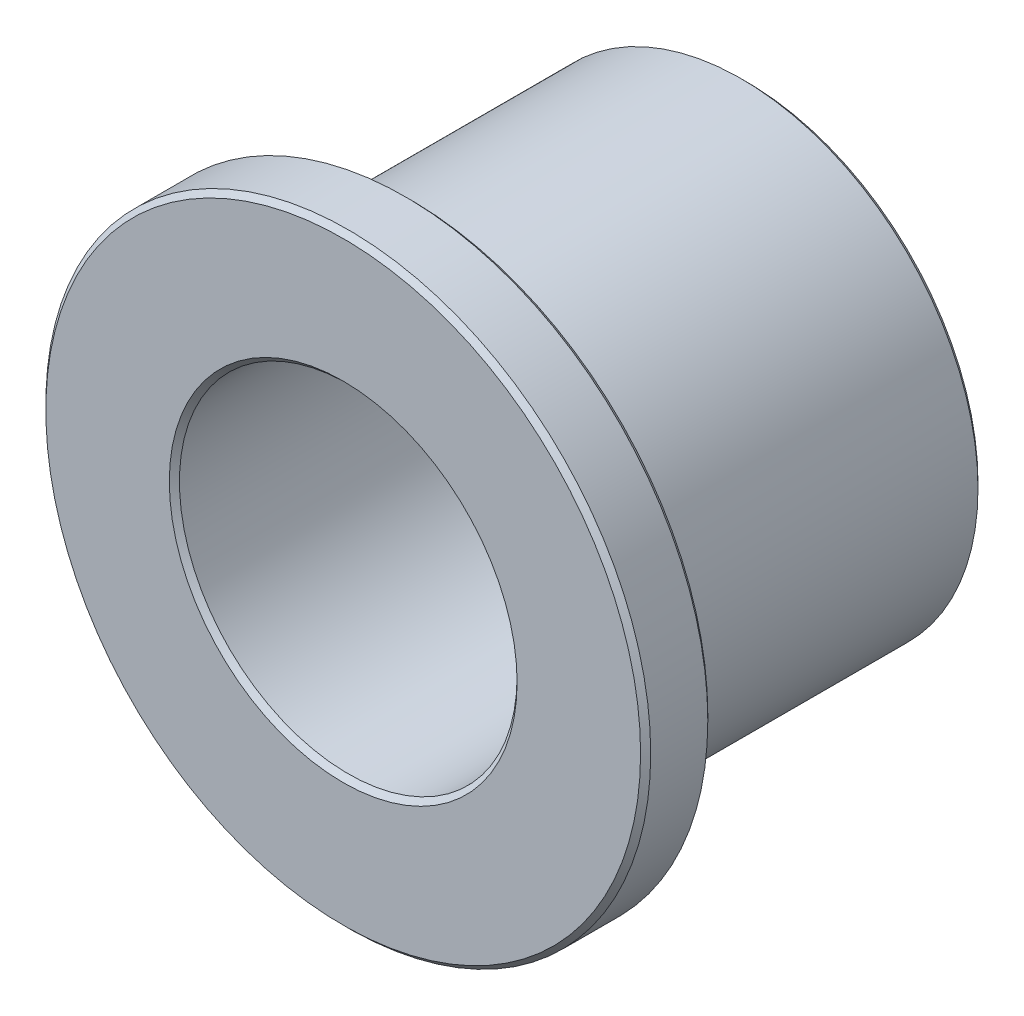
ISO-10303-21;
HEADER;
FILE_DESCRIPTION(('STEP AP214'),'2;1');
FILE_NAME('part.step','',(''),(''),'','','');
FILE_SCHEMA(('AUTOMOTIVE_DESIGN { 1 0 10303 214 1 1 1 1 }'));
ENDSEC;
DATA;
#1=APPLICATION_CONTEXT('core data for automotive mechanical design processes');
#2=APPLICATION_PROTOCOL_DEFINITION('international standard','automotive_design',2000,#1);
#3=PRODUCT_CONTEXT('',#1,'mechanical');
#4=PRODUCT('Part','Part','',(#3));
#5=PRODUCT_RELATED_PRODUCT_CATEGORY('part','',(#4));
#6=PRODUCT_DEFINITION_FORMATION('','',#4);
#7=PRODUCT_DEFINITION_CONTEXT('part definition',#1,'design');
#8=PRODUCT_DEFINITION('design','',#6,#7);
#9=PRODUCT_DEFINITION_SHAPE('','',#8);
#10=(LENGTH_UNIT() NAMED_UNIT(*) SI_UNIT(.MILLI.,.METRE.));
#11=(NAMED_UNIT(*) PLANE_ANGLE_UNIT() SI_UNIT($,.RADIAN.));
#12=(NAMED_UNIT(*) SI_UNIT($,.STERADIAN.) SOLID_ANGLE_UNIT());
#13=UNCERTAINTY_MEASURE_WITH_UNIT(LENGTH_MEASURE(1.E-05),#10,'distance_accuracy_value','');
#14=(GEOMETRIC_REPRESENTATION_CONTEXT(3) GLOBAL_UNCERTAINTY_ASSIGNED_CONTEXT((#13)) GLOBAL_UNIT_ASSIGNED_CONTEXT((#10,
#11,#12)) REPRESENTATION_CONTEXT('',''));
#15=CARTESIAN_POINT('',(0.,0.,0.));
#16=DIRECTION('',(0.,0.,1.));
#17=DIRECTION('',(1.,0.,0.));
#18=AXIS2_PLACEMENT_3D('',#15,#16,#17);
#19=CARTESIAN_POINT('',(0.,0.,3.175));
#20=DIRECTION('',(0.,0.,1.));
#21=DIRECTION('',(1.,0.,0.));
#22=AXIS2_PLACEMENT_3D('',#19,#20,#21);
#23=CYLINDRICAL_SURFACE('',#22,7.14375);
#24=CARTESIAN_POINT('',(0.,0.,4.64286599999999));
#25=DIRECTION('',(0.,0.,1.));
#26=DIRECTION('',(1.,0.,0.));
#27=AXIS2_PLACEMENT_3D('',#24,#25,#26);
#28=CIRCLE('',#27,7.14375);
#29=CARTESIAN_POINT('',(7.14375,0.,4.64286599999999));
#30=VERTEX_POINT('',#29);
#31=EDGE_CURVE('E56',#30,#30,#28,.F.);
#32=ORIENTED_EDGE('',*,*,#31,.T.);
#33=EDGE_LOOP('',(#32));
#34=FACE_BOUND('',#33,.T.);
#35=CARTESIAN_POINT('',(0.,0.,3.29463399999999));
#36=DIRECTION('',(0.,0.,1.));
#37=DIRECTION('',(1.,0.,0.));
#38=AXIS2_PLACEMENT_3D('',#35,#36,#37);
#39=CIRCLE('',#38,7.14375);
#40=CARTESIAN_POINT('',(7.14375,0.,3.29463399999999));
#41=VERTEX_POINT('',#40);
#42=EDGE_CURVE('E59',#41,#41,#39,.T.);
#43=ORIENTED_EDGE('',*,*,#42,.T.);
#44=EDGE_LOOP('',(#43));
#45=FACE_BOUND('',#44,.T.);
#46=ADVANCED_FACE('F30',(#34,#45),#23,.T.);
#47=CARTESIAN_POINT('',(0.,0.,3.175));
#48=DIRECTION('',(0.,0.,1.));
#49=DIRECTION('',(1.,0.,0.));
#50=AXIS2_PLACEMENT_3D('',#47,#48,#49);
#51=PLANE('',#50);
#52=CARTESIAN_POINT('',(0.,0.,3.175));
#53=DIRECTION('',(0.,0.,1.));
#54=DIRECTION('',(1.,0.,0.));
#55=AXIS2_PLACEMENT_3D('',#52,#53,#54);
#56=CIRCLE('',#55,7.024116);
#57=CARTESIAN_POINT('',(7.024116,0.,3.175));
#58=VERTEX_POINT('',#57);
#59=EDGE_CURVE('E50',#58,#58,#56,.F.);
#60=ORIENTED_EDGE('',*,*,#59,.T.);
#61=EDGE_LOOP('',(#60));
#62=FACE_BOUND('',#61,.T.);
#63=CARTESIAN_POINT('',(0.,0.,3.175));
#64=DIRECTION('',(0.,0.,1.));
#65=DIRECTION('',(1.,0.,0.));
#66=AXIS2_PLACEMENT_3D('',#63,#64,#65);
#67=CIRCLE('',#66,5.707634);
#68=CARTESIAN_POINT('',(5.707634,0.,3.175));
#69=VERTEX_POINT('',#68);
#70=EDGE_CURVE('E53',#69,#69,#67,.T.);
#71=ORIENTED_EDGE('',*,*,#70,.T.);
#72=EDGE_LOOP('',(#71));
#73=FACE_BOUND('',#72,.T.);
#74=ADVANCED_FACE('F90',(#62,#73),#51,.F.);
#75=CARTESIAN_POINT('',(0.,0.,4.7625));
#76=DIRECTION('',(0.,0.,1.));
#77=DIRECTION('',(1.,0.,0.));
#78=AXIS2_PLACEMENT_3D('',#75,#76,#77);
#79=PLANE('',#78);
#80=CARTESIAN_POINT('',(0.,0.,4.7625));
#81=DIRECTION('',(0.,0.,1.));
#82=DIRECTION('',(1.,0.,0.));
#83=AXIS2_PLACEMENT_3D('',#80,#81,#82);
#84=CIRCLE('',#83,4.107434);
#85=CARTESIAN_POINT('',(4.107434,0.,4.7625));
#86=VERTEX_POINT('',#85);
#87=EDGE_CURVE('E62',#86,#86,#84,.F.);
#88=ORIENTED_EDGE('',*,*,#87,.T.);
#89=EDGE_LOOP('',(#88));
#90=FACE_BOUND('',#89,.T.);
#91=CARTESIAN_POINT('',(0.,0.,4.7625));
#92=DIRECTION('',(0.,0.,1.));
#93=DIRECTION('',(1.,0.,0.));
#94=AXIS2_PLACEMENT_3D('',#91,#92,#93);
#95=CIRCLE('',#94,7.024116);
#96=CARTESIAN_POINT('',(7.024116,0.,4.7625));
#97=VERTEX_POINT('',#96);
#98=EDGE_CURVE('E65',#97,#97,#95,.T.);
#99=ORIENTED_EDGE('',*,*,#98,.T.);
#100=EDGE_LOOP('',(#99));
#101=FACE_BOUND('',#100,.T.);
#102=ADVANCED_FACE('F96',(#90,#101),#79,.T.);
#103=CARTESIAN_POINT('',(0.,0.,3.175));
#104=DIRECTION('',(0.,0.,1.));
#105=DIRECTION('',(1.,0.,0.));
#106=AXIS2_PLACEMENT_3D('',#103,#104,#105);
#107=CYLINDRICAL_SURFACE('',#106,3.9878);
#108=CARTESIAN_POINT('',(0.,0.,4.642866));
#109=DIRECTION('',(0.,0.,1.));
#110=DIRECTION('',(1.,0.,0.));
#111=AXIS2_PLACEMENT_3D('',#108,#109,#110);
#112=CIRCLE('',#111,3.9878);
#113=CARTESIAN_POINT('',(3.9878,0.,4.642866));
#114=VERTEX_POINT('',#113);
#115=EDGE_CURVE('E68',#114,#114,#112,.T.);
#116=ORIENTED_EDGE('',*,*,#115,.T.);
#117=EDGE_LOOP('',(#116));
#118=FACE_BOUND('',#117,.T.);
#119=CARTESIAN_POINT('',(0.,0.,-4.642866));
#120=DIRECTION('',(0.,0.,1.));
#121=DIRECTION('',(1.,0.,0.));
#122=AXIS2_PLACEMENT_3D('',#119,#120,#121);
#123=CIRCLE('',#122,3.9878);
#124=CARTESIAN_POINT('',(-3.9878,0.,-4.642866));
#125=VERTEX_POINT('',#124);
#126=EDGE_CURVE('E71',#125,#125,#123,.F.);
#127=ORIENTED_EDGE('',*,*,#126,.T.);
#128=EDGE_LOOP('',(#127));
#129=FACE_BOUND('',#128,.T.);
#130=ADVANCED_FACE('F75',(#118,#129),#107,.F.);
#131=CARTESIAN_POINT('',(0.,0.,-4.7625));
#132=DIRECTION('',(0.,0.,1.));
#133=DIRECTION('',(1.,0.,0.));
#134=AXIS2_PLACEMENT_3D('',#131,#132,#133);
#135=CYLINDRICAL_SURFACE('',#134,5.588);
#136=CARTESIAN_POINT('',(0.,0.,3.055366));
#137=DIRECTION('',(0.,0.,1.));
#138=DIRECTION('',(1.,0.,0.));
#139=AXIS2_PLACEMENT_3D('',#136,#137,#138);
#140=CIRCLE('',#139,5.588);
#141=CARTESIAN_POINT('',(5.588,0.,3.055366));
#142=VERTEX_POINT('',#141);
#143=EDGE_CURVE('E41',#142,#142,#140,.F.);
#144=ORIENTED_EDGE('',*,*,#143,.T.);
#145=EDGE_LOOP('',(#144));
#146=FACE_BOUND('',#145,.T.);
#147=CARTESIAN_POINT('',(0.,0.,-4.64286599999999));
#148=DIRECTION('',(0.,0.,1.));
#149=DIRECTION('',(1.,0.,0.));
#150=AXIS2_PLACEMENT_3D('',#147,#148,#149);
#151=CIRCLE('',#150,5.588);
#152=CARTESIAN_POINT('',(5.588,0.,-4.64286599999999));
#153=VERTEX_POINT('',#152);
#154=EDGE_CURVE('E45',#153,#153,#151,.T.);
#155=ORIENTED_EDGE('',*,*,#154,.T.);
#156=EDGE_LOOP('',(#155));
#157=FACE_BOUND('',#156,.T.);
#158=ADVANCED_FACE('F158',(#146,#157),#135,.T.);
#159=CARTESIAN_POINT('',(0.,0.,-4.7625));
#160=DIRECTION('',(0.,0.,1.));
#161=DIRECTION('',(1.,0.,0.));
#162=AXIS2_PLACEMENT_3D('',#159,#160,#161);
#163=PLANE('',#162);
#164=CARTESIAN_POINT('',(0.,0.,-4.7625));
#165=DIRECTION('',(0.,0.,1.));
#166=DIRECTION('',(1.,0.,0.));
#167=AXIS2_PLACEMENT_3D('',#164,#165,#166);
#168=CIRCLE('',#167,4.107434);
#169=CARTESIAN_POINT('',(-4.107434,0.,-4.7625));
#170=VERTEX_POINT('',#169);
#171=EDGE_CURVE('E10',#170,#170,#168,.T.);
#172=ORIENTED_EDGE('',*,*,#171,.T.);
#173=EDGE_LOOP('',(#172));
#174=FACE_BOUND('',#173,.T.);
#175=CARTESIAN_POINT('',(0.,0.,-4.7625));
#176=DIRECTION('',(0.,0.,1.));
#177=DIRECTION('',(1.,0.,0.));
#178=AXIS2_PLACEMENT_3D('',#175,#176,#177);
#179=CIRCLE('',#178,5.468366);
#180=CARTESIAN_POINT('',(5.468366,0.,-4.7625));
#181=VERTEX_POINT('',#180);
#182=EDGE_CURVE('E37',#181,#181,#179,.F.);
#183=ORIENTED_EDGE('',*,*,#182,.T.);
#184=EDGE_LOOP('',(#183));
#185=FACE_BOUND('',#184,.T.);
#186=ADVANCED_FACE('F106',(#174,#185),#163,.F.);
#187=CARTESIAN_POINT('',(0.,0.,4.642866));
#188=DIRECTION('',(0.,0.,1.));
#189=DIRECTION('',(1.,0.,0.));
#190=AXIS2_PLACEMENT_3D('',#187,#188,#189);
#191=CONICAL_SURFACE('',#190,3.9878,0.785398163397448);
#192=ORIENTED_EDGE('',*,*,#87,.F.);
#193=EDGE_LOOP('',(#192));
#194=FACE_BOUND('',#193,.T.);
#195=ORIENTED_EDGE('',*,*,#115,.F.);
#196=EDGE_LOOP('',(#195));
#197=FACE_BOUND('',#196,.T.);
#198=ADVANCED_FACE('F102',(#194,#197),#191,.F.);
#199=CARTESIAN_POINT('',(0.,0.,4.7625));
#200=DIRECTION('',(0.,0.,-1.));
#201=DIRECTION('',(-1.,0.,0.));
#202=AXIS2_PLACEMENT_3D('',#199,#200,#201);
#203=CONICAL_SURFACE('',#202,7.024116,0.785398163397452);
#204=ORIENTED_EDGE('',*,*,#31,.F.);
#205=EDGE_LOOP('',(#204));
#206=FACE_BOUND('',#205,.T.);
#207=ORIENTED_EDGE('',*,*,#98,.F.);
#208=EDGE_LOOP('',(#207));
#209=FACE_BOUND('',#208,.T.);
#210=ADVANCED_FACE('F105',(#206,#209),#203,.T.);
#211=CARTESIAN_POINT('',(0.,0.,3.29463399999999));
#212=DIRECTION('',(0.,0.,1.));
#213=DIRECTION('',(1.,0.,0.));
#214=AXIS2_PLACEMENT_3D('',#211,#212,#213);
#215=CONICAL_SURFACE('',#214,7.14375,0.785398163397452);
#216=ORIENTED_EDGE('',*,*,#59,.F.);
#217=EDGE_LOOP('',(#216));
#218=FACE_BOUND('',#217,.T.);
#219=ORIENTED_EDGE('',*,*,#42,.F.);
#220=EDGE_LOOP('',(#219));
#221=FACE_BOUND('',#220,.T.);
#222=ADVANCED_FACE('F86',(#218,#221),#215,.T.);
#223=CARTESIAN_POINT('',(0.,0.,3.175));
#224=DIRECTION('',(0.,0.,1.));
#225=DIRECTION('',(1.,0.,0.));
#226=AXIS2_PLACEMENT_3D('',#223,#224,#225);
#227=CONICAL_SURFACE('',#226,5.707634,0.785398163397452);
#228=ORIENTED_EDGE('',*,*,#143,.F.);
#229=EDGE_LOOP('',(#228));
#230=FACE_BOUND('',#229,.T.);
#231=ORIENTED_EDGE('',*,*,#70,.F.);
#232=EDGE_LOOP('',(#231));
#233=FACE_BOUND('',#232,.T.);
#234=ADVANCED_FACE('F80',(#230,#233),#227,.T.);
#235=CARTESIAN_POINT('',(0.,0.,-4.7625));
#236=DIRECTION('',(0.,0.,-1.));
#237=DIRECTION('',(-1.,0.,0.));
#238=AXIS2_PLACEMENT_3D('',#235,#236,#237);
#239=CONICAL_SURFACE('',#238,4.107434,0.785398163397455);
#240=CARTESIAN_POINT('',(-3.9878,0.,-4.642866));
#241=CARTESIAN_POINT('',(-3.9890461875,0.,-4.6441121875));
#242=CARTESIAN_POINT('',(-3.990292375,0.,-4.645358375));
#243=CARTESIAN_POINT('',(-3.99278475,0.,-4.64785075));
#244=CARTESIAN_POINT('',(-3.9940309375,0.,-4.6490969375));
#245=CARTESIAN_POINT('',(-3.9965233125,0.,-4.6515893125));
#246=CARTESIAN_POINT('',(-3.9977695,0.,-4.6528355));
#247=CARTESIAN_POINT('',(-4.000261875,0.,-4.655327875));
#248=CARTESIAN_POINT('',(-4.0015080625,0.,-4.6565740625));
#249=CARTESIAN_POINT('',(-4.0040004375,0.,-4.6590664375));
#250=CARTESIAN_POINT('',(-4.005246625,0.,-4.660312625));
#251=CARTESIAN_POINT('',(-4.007739,0.,-4.662805));
#252=CARTESIAN_POINT('',(-4.0089851875,0.,-4.6640511875));
#253=CARTESIAN_POINT('',(-4.0114775625,0.,-4.6665435625));
#254=CARTESIAN_POINT('',(-4.01272375,0.,-4.66778975));
#255=CARTESIAN_POINT('',(-4.015216125,0.,-4.670282125));
#256=CARTESIAN_POINT('',(-4.0164623125,0.,-4.6715283125));
#257=CARTESIAN_POINT('',(-4.0189546875,0.,-4.6740206875));
#258=CARTESIAN_POINT('',(-4.020200875,0.,-4.675266875));
#259=CARTESIAN_POINT('',(-4.02269325,0.,-4.67775925));
#260=CARTESIAN_POINT('',(-4.0239394375,0.,-4.6790054375));
#261=CARTESIAN_POINT('',(-4.0264318125,0.,-4.6814978125));
#262=CARTESIAN_POINT('',(-4.027678,0.,-4.682744));
#263=CARTESIAN_POINT('',(-4.030170375,0.,-4.685236375));
#264=CARTESIAN_POINT('',(-4.0314165625,0.,-4.6864825625));
#265=CARTESIAN_POINT('',(-4.0339089375,0.,-4.6889749375));
#266=CARTESIAN_POINT('',(-4.035155125,0.,-4.690221125));
#267=CARTESIAN_POINT('',(-4.0376475,0.,-4.6927135));
#268=CARTESIAN_POINT('',(-4.0388936875,0.,-4.6939596875));
#269=CARTESIAN_POINT('',(-4.0413860625,0.,-4.6964520625));
#270=CARTESIAN_POINT('',(-4.04263225,0.,-4.69769825));
#271=CARTESIAN_POINT('',(-4.045124625,0.,-4.700190625));
#272=CARTESIAN_POINT('',(-4.0463708125,0.,-4.7014368125));
#273=CARTESIAN_POINT('',(-4.0488631875,0.,-4.7039291875));
#274=CARTESIAN_POINT('',(-4.050109375,0.,-4.705175375));
#275=CARTESIAN_POINT('',(-4.05260175,0.,-4.70766775));
#276=CARTESIAN_POINT('',(-4.0538479375,0.,-4.7089139375));
#277=CARTESIAN_POINT('',(-4.0563403125,0.,-4.7114063125));
#278=CARTESIAN_POINT('',(-4.0575865,0.,-4.7126525));
#279=CARTESIAN_POINT('',(-4.060078875,0.,-4.715144875));
#280=CARTESIAN_POINT('',(-4.0613250625,0.,-4.7163910625));
#281=CARTESIAN_POINT('',(-4.0638174375,0.,-4.7188834375));
#282=CARTESIAN_POINT('',(-4.065063625,0.,-4.720129625));
#283=CARTESIAN_POINT('',(-4.067556,0.,-4.722622));
#284=CARTESIAN_POINT('',(-4.0688021875,0.,-4.7238681875));
#285=CARTESIAN_POINT('',(-4.0712945625,0.,-4.7263605625));
#286=CARTESIAN_POINT('',(-4.07254075,0.,-4.72760675));
#287=CARTESIAN_POINT('',(-4.075033125,0.,-4.730099125));
#288=CARTESIAN_POINT('',(-4.0762793125,0.,-4.7313453125));
#289=CARTESIAN_POINT('',(-4.0787716875,0.,-4.7338376875));
#290=CARTESIAN_POINT('',(-4.080017875,0.,-4.735083875));
#291=CARTESIAN_POINT('',(-4.08251025,0.,-4.73757625));
#292=CARTESIAN_POINT('',(-4.0837564375,0.,-4.7388224375));
#293=CARTESIAN_POINT('',(-4.0862488125,0.,-4.7413148125));
#294=CARTESIAN_POINT('',(-4.087495,0.,-4.742561));
#295=CARTESIAN_POINT('',(-4.089987375,0.,-4.745053375));
#296=CARTESIAN_POINT('',(-4.0912335625,0.,-4.7462995625));
#297=CARTESIAN_POINT('',(-4.0937259375,0.,-4.7487919375));
#298=CARTESIAN_POINT('',(-4.094972125,0.,-4.750038125));
#299=CARTESIAN_POINT('',(-4.0974645,0.,-4.7525305));
#300=CARTESIAN_POINT('',(-4.0987106875,0.,-4.7537766875));
#301=CARTESIAN_POINT('',(-4.1012030625,0.,-4.7562690625));
#302=CARTESIAN_POINT('',(-4.10244925,0.,-4.75751525));
#303=CARTESIAN_POINT('',(-4.104941625,0.,-4.760007625));
#304=CARTESIAN_POINT('',(-4.1061878125,0.,-4.7612538125));
#305=CARTESIAN_POINT('',(-4.107434,0.,-4.7625));
#306=B_SPLINE_CURVE_WITH_KNOTS('',3,(#240,#241,#242,#243,#244,#245,#246,#247,#248,#249,#250,
#251,#252,#253,#254,#255,#256,#257,#258,#259,#260,#261,#262,#263,#264,#265,#266,#267,#268,#269,
#270,#271,#272,#273,#274,#275,#276,#277,#278,#279,#280,#281,#282,#283,#284,#285,#286,#287,#288,
#289,#290,#291,#292,#293,#294,#295,#296,#297,#298,#299,#300,#301,#302,#303,#304,#305),
.UNSPECIFIED.,.F.,.F.,(4,2,2,2,2,2,2,2,2,2,2,2,2,2,2,2,2,2,2,2,2,2,2,2,2,2,2,2,2,2,2,2,4),(0.,
0.00528712579127856,0.0105742515825584,0.0158613773738375,0.0211485031651167,0.0264356289563965,
0.0317227547476757,0.0370098805389548,0.0422970063302346,0.0475841321215138,0.052871257912793,
0.0581583837040721,0.0634455094953519,0.0687326352866311,0.0740197610779103,0.0793068868691901,
0.0845940126604698,0.0898811384517484,0.0951682642430282,0.100455390034307,0.105742515825587,
0.111029641616866,0.116316767408145,0.121603893199425,0.126891018990704,0.132178144781984,
0.137465270573263,0.142752396364542,0.148039522155822,0.153326647947101,0.15861377373838,
0.16390089952966,0.169188025320939),.UNSPECIFIED.);
#307=EDGE_CURVE('BSEAM77',#125,#170,#306,.T.);
#308=ORIENTED_EDGE('',*,*,#126,.F.);
#309=ORIENTED_EDGE('',*,*,#171,.F.);
#310=ORIENTED_EDGE('',*,*,#307,.T.);
#311=ORIENTED_EDGE('',*,*,#307,.F.);
#312=EDGE_LOOP('',(#308,#310,#309,#311));
#313=FACE_BOUND('',#312,.T.);
#314=ADVANCED_FACE('F77',(#313),#239,.F.);
#315=CARTESIAN_POINT('',(0.,0.,-4.64286599999999));
#316=DIRECTION('',(0.,0.,1.));
#317=DIRECTION('',(1.,0.,0.));
#318=AXIS2_PLACEMENT_3D('',#315,#316,#317);
#319=CONICAL_SURFACE('',#318,5.588,0.785398163397452);
#320=ORIENTED_EDGE('',*,*,#182,.F.);
#321=EDGE_LOOP('',(#320));
#322=FACE_BOUND('',#321,.T.);
#323=ORIENTED_EDGE('',*,*,#154,.F.);
#324=EDGE_LOOP('',(#323));
#325=FACE_BOUND('',#324,.T.);
#326=ADVANCED_FACE('F32',(#322,#325),#319,.T.);
#327=CLOSED_SHELL('',(#46,#74,#102,#130,#158,#186,#198,#210,#222,#234,#314,#326));
#328=MANIFOLD_SOLID_BREP('B2',#327);
#329=ADVANCED_BREP_SHAPE_REPRESENTATION('',(#18,#328),#14);
#330=SHAPE_DEFINITION_REPRESENTATION(#9,#329);
ENDSEC;
END-ISO-10303-21;
